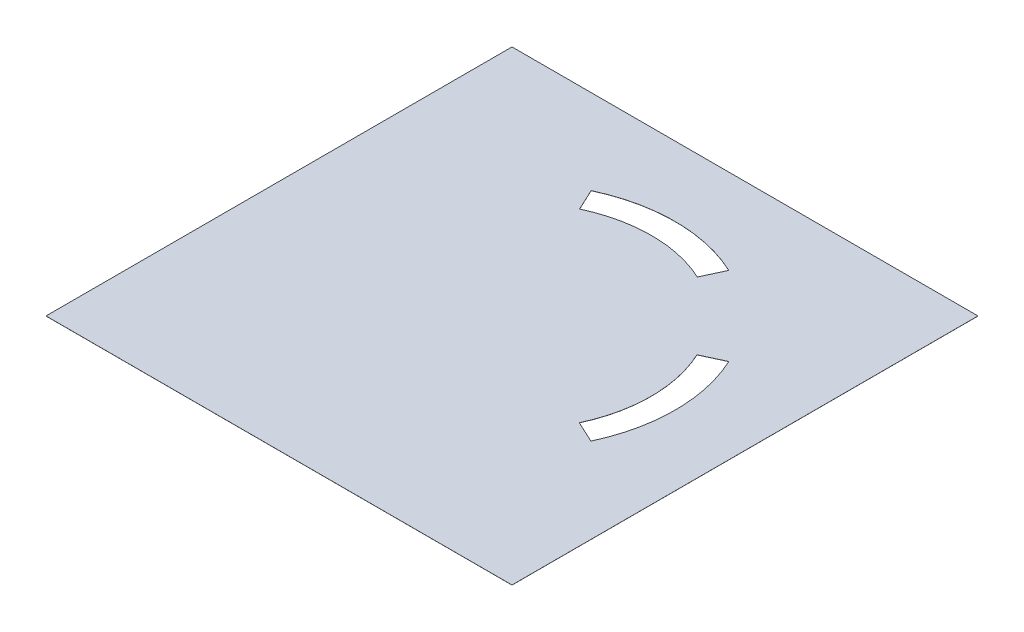
ISO-10303-21;
HEADER;
FILE_DESCRIPTION(('STEP AP214'),'2;1');
FILE_NAME('part.step','',(''),(''),'','','');
FILE_SCHEMA(('AUTOMOTIVE_DESIGN { 1 0 10303 214 1 1 1 1 }'));
ENDSEC;
DATA;
#1=APPLICATION_CONTEXT('core data for automotive mechanical design processes');
#2=APPLICATION_PROTOCOL_DEFINITION('international standard','automotive_design',2000,#1);
#3=PRODUCT_CONTEXT('',#1,'mechanical');
#4=PRODUCT('Part','Part','',(#3));
#5=PRODUCT_RELATED_PRODUCT_CATEGORY('part','',(#4));
#6=PRODUCT_DEFINITION_FORMATION('','',#4);
#7=PRODUCT_DEFINITION_CONTEXT('part definition',#1,'design');
#8=PRODUCT_DEFINITION('design','',#6,#7);
#9=PRODUCT_DEFINITION_SHAPE('','',#8);
#10=(LENGTH_UNIT() NAMED_UNIT(*) SI_UNIT(.MILLI.,.METRE.));
#11=(NAMED_UNIT(*) PLANE_ANGLE_UNIT() SI_UNIT($,.RADIAN.));
#12=(NAMED_UNIT(*) SI_UNIT($,.STERADIAN.) SOLID_ANGLE_UNIT());
#13=UNCERTAINTY_MEASURE_WITH_UNIT(LENGTH_MEASURE(1.E-05),#10,'distance_accuracy_value','');
#14=(GEOMETRIC_REPRESENTATION_CONTEXT(3) GLOBAL_UNCERTAINTY_ASSIGNED_CONTEXT((#13)) GLOBAL_UNIT_ASSIGNED_CONTEXT((#10,
#11,#12)) REPRESENTATION_CONTEXT('',''));
#15=CARTESIAN_POINT('',(0.,0.,0.));
#16=DIRECTION('',(0.,0.,1.));
#17=DIRECTION('',(1.,0.,0.));
#18=AXIS2_PLACEMENT_3D('',#15,#16,#17);
#19=CARTESIAN_POINT('',(0.,0.02,0.));
#20=DIRECTION('',(0.,-1.,0.));
#21=DIRECTION('',(0.,0.,-1.));
#22=AXIS2_PLACEMENT_3D('',#19,#20,#21);
#23=PLANE('',#22);
#24=CARTESIAN_POINT('',(53.5490993647064,0.02,-53.5652361851877));
#25=DIRECTION('',(0.,-1.,0.));
#26=DIRECTION('',(0.,0.,-1.));
#27=AXIS2_PLACEMENT_3D('',#24,#25,#26);
#28=CIRCLE('',#27,32.0102361851877);
#29=CARTESIAN_POINT('',(40.0209889902134,0.02,-82.5763625047057));
#30=VERTEX_POINT('',#29);
#31=CARTESIAN_POINT('',(67.0772097391996,0.02,-82.5763625047056));
#32=VERTEX_POINT('',#31);
#33=EDGE_CURVE('E158',#30,#32,#28,.T.);
#34=ORIENTED_EDGE('',*,*,#33,.F.);
#35=DIRECTION('',(0.422618261740692,0.,0.906307787036653));
#36=VECTOR('',#35,1.);
#37=CARTESIAN_POINT('',(40.0209889902134,0.02,-82.5763625047057));
#38=LINE('',#37,#36);
#39=CARTESIAN_POINT('',(37.6952675499589,0.02,-87.5638882285091));
#40=VERTEX_POINT('',#39);
#41=EDGE_CURVE('E166',#40,#30,#38,.T.);
#42=ORIENTED_EDGE('',*,*,#41,.F.);
#43=CARTESIAN_POINT('',(53.470767951941,0.02,-53.8846169663621));
#44=DIRECTION('',(0.,1.,0.));
#45=DIRECTION('',(0.,0.,-1.));
#46=AXIS2_PLACEMENT_3D('',#43,#44,#45);
#47=CIRCLE('',#46,37.1908554040132);
#48=CARTESIAN_POINT('',(69.3747324500413,0.02,-87.5034158581337));
#49=VERTEX_POINT('',#48);
#50=EDGE_CURVE('E163',#49,#40,#47,.T.);
#51=ORIENTED_EDGE('',*,*,#50,.F.);
#52=DIRECTION('',(0.422618261740697,0.,-0.906307787036651));
#53=VECTOR('',#52,1.);
#54=CARTESIAN_POINT('',(67.0772097391996,0.02,-82.5763625047056));
#55=LINE('',#54,#53);
#56=EDGE_CURVE('E160',#32,#49,#55,.T.);
#57=ORIENTED_EDGE('',*,*,#56,.F.);
#58=EDGE_LOOP('',(#34,#42,#51,#57));
#59=FACE_BOUND('',#58,.T.);
#60=DIRECTION('',(1.,0.,0.));
#61=VECTOR('',#60,1.);
#62=CARTESIAN_POINT('',(0.,0.02,0.));
#63=LINE('',#62,#61);
#64=CARTESIAN_POINT('',(0.,0.02,0.));
#65=VERTEX_POINT('',#64);
#66=CARTESIAN_POINT('',(107.07,0.02,0.));
#67=VERTEX_POINT('',#66);
#68=EDGE_CURVE('E189',#65,#67,#63,.T.);
#69=ORIENTED_EDGE('',*,*,#68,.T.);
#70=DIRECTION('',(0.,0.,-1.));
#71=VECTOR('',#70,1.);
#72=CARTESIAN_POINT('',(107.07,0.02,-107.07));
#73=LINE('',#72,#71);
#74=CARTESIAN_POINT('',(107.07,0.02,-107.07));
#75=VERTEX_POINT('',#74);
#76=EDGE_CURVE('E192',#67,#75,#73,.T.);
#77=ORIENTED_EDGE('',*,*,#76,.T.);
#78=DIRECTION('',(-1.,0.,0.));
#79=VECTOR('',#78,1.);
#80=CARTESIAN_POINT('',(0.,0.02,-107.07));
#81=LINE('',#80,#79);
#82=CARTESIAN_POINT('',(0.,0.02,-107.07));
#83=VERTEX_POINT('',#82);
#84=EDGE_CURVE('E195',#75,#83,#81,.T.);
#85=ORIENTED_EDGE('',*,*,#84,.T.);
#86=DIRECTION('',(0.,0.,1.));
#87=VECTOR('',#86,1.);
#88=CARTESIAN_POINT('',(0.,0.02,0.));
#89=LINE('',#88,#87);
#90=EDGE_CURVE('E197',#83,#65,#89,.T.);
#91=ORIENTED_EDGE('',*,*,#90,.T.);
#92=EDGE_LOOP('',(#69,#77,#85,#91));
#93=FACE_BOUND('',#92,.T.);
#94=CARTESIAN_POINT('',(53.5349999999999,0.02,-53.535));
#95=DIRECTION('',(0.,-1.,0.));
#96=DIRECTION('',(0.,0.,-1.));
#97=AXIS2_PLACEMENT_3D('',#94,#95,#96);
#98=CIRCLE('',#97,31.9800000000001);
#99=CARTESIAN_POINT('',(82.518723029432,0.02,-67.0503320104676));
#100=VERTEX_POINT('',#99);
#101=CARTESIAN_POINT('',(82.5187230294321,0.02,-40.0196679895324));
#102=VERTEX_POINT('',#101);
#103=EDGE_CURVE('E122',#100,#102,#98,.T.);
#104=ORIENTED_EDGE('',*,*,#103,.F.);
#105=DIRECTION('',(-0.906307787036649,0.,0.422618261740701));
#106=VECTOR('',#105,1.);
#107=CARTESIAN_POINT('',(82.518723029432,0.02,-67.0503320104676));
#108=LINE('',#107,#106);
#109=CARTESIAN_POINT('',(87.5034158581336,0.02,-69.3747324500415));
#110=VERTEX_POINT('',#109);
#111=EDGE_CURVE('E144',#110,#100,#108,.T.);
#112=ORIENTED_EDGE('',*,*,#111,.F.);
#113=CARTESIAN_POINT('',(53.535,0.02,-53.535));
#114=DIRECTION('',(0.,1.,0.));
#115=DIRECTION('',(0.,0.,-1.));
#116=AXIS2_PLACEMENT_3D('',#113,#114,#115);
#117=CIRCLE('',#116,37.48);
#118=CARTESIAN_POINT('',(87.5034158581336,0.02,-37.6952675499585));
#119=VERTEX_POINT('',#118);
#120=EDGE_CURVE('E142',#119,#110,#117,.T.);
#121=ORIENTED_EDGE('',*,*,#120,.F.);
#122=DIRECTION('',(0.906307787036649,0.,0.422618261740701));
#123=VECTOR('',#122,1.);
#124=CARTESIAN_POINT('',(82.5187230294321,0.02,-40.0196679895324));
#125=LINE('',#124,#123);
#126=EDGE_CURVE('E130',#102,#119,#125,.T.);
#127=ORIENTED_EDGE('',*,*,#126,.F.);
#128=EDGE_LOOP('',(#104,#112,#121,#127));
#129=FACE_BOUND('',#128,.T.);
#130=ADVANCED_FACE('F33',(#59,#93,#129),#23,.F.);
#131=CARTESIAN_POINT('',(0.,0.,0.));
#132=DIRECTION('',(0.,-1.,0.));
#133=DIRECTION('',(0.,0.,-1.));
#134=AXIS2_PLACEMENT_3D('',#131,#132,#133);
#135=PLANE('',#134);
#136=DIRECTION('',(1.,0.,0.));
#137=VECTOR('',#136,1.);
#138=CARTESIAN_POINT('',(0.,0.,0.));
#139=LINE('',#138,#137);
#140=CARTESIAN_POINT('',(0.,0.,0.));
#141=VERTEX_POINT('',#140);
#142=CARTESIAN_POINT('',(107.07,0.,0.));
#143=VERTEX_POINT('',#142);
#144=EDGE_CURVE('E188',#141,#143,#139,.T.);
#145=ORIENTED_EDGE('',*,*,#144,.F.);
#146=DIRECTION('',(0.,0.,1.));
#147=VECTOR('',#146,1.);
#148=CARTESIAN_POINT('',(0.,0.,0.));
#149=LINE('',#148,#147);
#150=CARTESIAN_POINT('',(0.,0.,-107.07));
#151=VERTEX_POINT('',#150);
#152=EDGE_CURVE('E193',#151,#141,#149,.T.);
#153=ORIENTED_EDGE('',*,*,#152,.F.);
#154=DIRECTION('',(-1.,0.,0.));
#155=VECTOR('',#154,1.);
#156=CARTESIAN_POINT('',(0.,0.,-107.07));
#157=LINE('',#156,#155);
#158=CARTESIAN_POINT('',(107.07,0.,-107.07));
#159=VERTEX_POINT('',#158);
#160=EDGE_CURVE('E204',#159,#151,#157,.T.);
#161=ORIENTED_EDGE('',*,*,#160,.F.);
#162=DIRECTION('',(0.,0.,-1.));
#163=VECTOR('',#162,1.);
#164=CARTESIAN_POINT('',(107.07,0.,-107.07));
#165=LINE('',#164,#163);
#166=EDGE_CURVE('E202',#143,#159,#165,.T.);
#167=ORIENTED_EDGE('',*,*,#166,.F.);
#168=EDGE_LOOP('',(#145,#153,#161,#167));
#169=FACE_BOUND('',#168,.T.);
#170=DIRECTION('',(0.422618261740692,0.,0.906307787036653));
#171=VECTOR('',#170,1.);
#172=CARTESIAN_POINT('',(40.0209889902134,0.,-82.5763625047057));
#173=LINE('',#172,#171);
#174=CARTESIAN_POINT('',(37.6952675499589,0.,-87.5638882285091));
#175=VERTEX_POINT('',#174);
#176=CARTESIAN_POINT('',(40.0209889902134,0.,-82.5763625047057));
#177=VERTEX_POINT('',#176);
#178=EDGE_CURVE('E161',#175,#177,#173,.T.);
#179=ORIENTED_EDGE('',*,*,#178,.T.);
#180=CARTESIAN_POINT('',(53.5490993647064,0.,-53.5652361851877));
#181=DIRECTION('',(0.,-1.,0.));
#182=DIRECTION('',(0.,0.,-1.));
#183=AXIS2_PLACEMENT_3D('',#180,#181,#182);
#184=CIRCLE('',#183,32.0102361851877);
#185=CARTESIAN_POINT('',(67.0772097391996,0.,-82.5763625047056));
#186=VERTEX_POINT('',#185);
#187=EDGE_CURVE('E138',#177,#186,#184,.T.);
#188=ORIENTED_EDGE('',*,*,#187,.T.);
#189=DIRECTION('',(0.422618261740697,0.,-0.906307787036651));
#190=VECTOR('',#189,1.);
#191=CARTESIAN_POINT('',(67.0772097391996,0.,-82.5763625047056));
#192=LINE('',#191,#190);
#193=CARTESIAN_POINT('',(69.3747324500413,0.,-87.5034158581337));
#194=VERTEX_POINT('',#193);
#195=EDGE_CURVE('E171',#186,#194,#192,.T.);
#196=ORIENTED_EDGE('',*,*,#195,.T.);
#197=CARTESIAN_POINT('',(53.470767951941,0.,-53.8846169663621));
#198=DIRECTION('',(0.,1.,0.));
#199=DIRECTION('',(0.,0.,-1.));
#200=AXIS2_PLACEMENT_3D('',#197,#198,#199);
#201=CIRCLE('',#200,37.1908554040132);
#202=EDGE_CURVE('E174',#194,#175,#201,.T.);
#203=ORIENTED_EDGE('',*,*,#202,.T.);
#204=EDGE_LOOP('',(#179,#188,#196,#203));
#205=FACE_BOUND('',#204,.T.);
#206=DIRECTION('',(-0.906307787036649,0.,0.422618261740701));
#207=VECTOR('',#206,1.);
#208=CARTESIAN_POINT('',(82.518723029432,0.,-67.0503320104676));
#209=LINE('',#208,#207);
#210=CARTESIAN_POINT('',(87.5034158581336,0.,-69.3747324500415));
#211=VERTEX_POINT('',#210);
#212=CARTESIAN_POINT('',(82.518723029432,0.,-67.0503320104676));
#213=VERTEX_POINT('',#212);
#214=EDGE_CURVE('E131',#211,#213,#209,.T.);
#215=ORIENTED_EDGE('',*,*,#214,.T.);
#216=CARTESIAN_POINT('',(53.5349999999999,0.,-53.535));
#217=DIRECTION('',(0.,-1.,0.));
#218=DIRECTION('',(0.,0.,-1.));
#219=AXIS2_PLACEMENT_3D('',#216,#217,#218);
#220=CIRCLE('',#219,31.9800000000001);
#221=CARTESIAN_POINT('',(82.5187230294321,0.,-40.0196679895324));
#222=VERTEX_POINT('',#221);
#223=EDGE_CURVE('E56',#213,#222,#220,.T.);
#224=ORIENTED_EDGE('',*,*,#223,.T.);
#225=DIRECTION('',(0.906307787036649,0.,0.422618261740701));
#226=VECTOR('',#225,1.);
#227=CARTESIAN_POINT('',(82.5187230294321,0.,-40.0196679895324));
#228=LINE('',#227,#226);
#229=CARTESIAN_POINT('',(87.5034158581336,0.,-37.6952675499585));
#230=VERTEX_POINT('',#229);
#231=EDGE_CURVE('E137',#222,#230,#228,.T.);
#232=ORIENTED_EDGE('',*,*,#231,.T.);
#233=CARTESIAN_POINT('',(53.535,0.,-53.535));
#234=DIRECTION('',(0.,1.,0.));
#235=DIRECTION('',(0.,0.,-1.));
#236=AXIS2_PLACEMENT_3D('',#233,#234,#235);
#237=CIRCLE('',#236,37.48);
#238=EDGE_CURVE('E150',#230,#211,#237,.T.);
#239=ORIENTED_EDGE('',*,*,#238,.T.);
#240=EDGE_LOOP('',(#215,#224,#232,#239));
#241=FACE_BOUND('',#240,.T.);
#242=ADVANCED_FACE('F222',(#169,#205,#241),#135,.T.);
#243=CARTESIAN_POINT('',(0.,0.02,0.));
#244=DIRECTION('',(0.,0.,-1.));
#245=DIRECTION('',(-1.,0.,0.));
#246=AXIS2_PLACEMENT_3D('',#243,#244,#245);
#247=PLANE('',#246);
#248=ORIENTED_EDGE('',*,*,#144,.T.);
#249=DIRECTION('',(0.,-1.,0.));
#250=VECTOR('',#249,1.);
#251=CARTESIAN_POINT('',(107.07,0.02,0.));
#252=LINE('',#251,#250);
#253=EDGE_CURVE('E11',#67,#143,#252,.T.);
#254=ORIENTED_EDGE('',*,*,#253,.F.);
#255=ORIENTED_EDGE('',*,*,#68,.F.);
#256=DIRECTION('',(0.,-1.,0.));
#257=VECTOR('',#256,1.);
#258=CARTESIAN_POINT('',(0.,0.02,0.));
#259=LINE('',#258,#257);
#260=EDGE_CURVE('E199',#65,#141,#259,.T.);
#261=ORIENTED_EDGE('',*,*,#260,.T.);
#262=EDGE_LOOP('',(#248,#254,#255,#261));
#263=FACE_BOUND('',#262,.T.);
#264=ADVANCED_FACE('F35',(#263),#247,.F.);
#265=CARTESIAN_POINT('',(107.07,0.02,-107.07));
#266=DIRECTION('',(-1.,0.,0.));
#267=DIRECTION('',(0.,0.,1.));
#268=AXIS2_PLACEMENT_3D('',#265,#266,#267);
#269=PLANE('',#268);
#270=ORIENTED_EDGE('',*,*,#166,.T.);
#271=DIRECTION('',(0.,-1.,0.));
#272=VECTOR('',#271,1.);
#273=CARTESIAN_POINT('',(107.07,0.02,-107.07));
#274=LINE('',#273,#272);
#275=EDGE_CURVE('E41',#75,#159,#274,.T.);
#276=ORIENTED_EDGE('',*,*,#275,.F.);
#277=ORIENTED_EDGE('',*,*,#76,.F.);
#278=ORIENTED_EDGE('',*,*,#253,.T.);
#279=EDGE_LOOP('',(#270,#276,#277,#278));
#280=FACE_BOUND('',#279,.T.);
#281=ADVANCED_FACE('F232',(#280),#269,.F.);
#282=CARTESIAN_POINT('',(0.,0.02,-107.07));
#283=DIRECTION('',(0.,0.,1.));
#284=DIRECTION('',(1.,0.,0.));
#285=AXIS2_PLACEMENT_3D('',#282,#283,#284);
#286=PLANE('',#285);
#287=ORIENTED_EDGE('',*,*,#160,.T.);
#288=DIRECTION('',(0.,-1.,0.));
#289=VECTOR('',#288,1.);
#290=CARTESIAN_POINT('',(0.,0.02,-107.07));
#291=LINE('',#290,#289);
#292=EDGE_CURVE('E209',#83,#151,#291,.T.);
#293=ORIENTED_EDGE('',*,*,#292,.F.);
#294=ORIENTED_EDGE('',*,*,#84,.F.);
#295=ORIENTED_EDGE('',*,*,#275,.T.);
#296=EDGE_LOOP('',(#287,#293,#294,#295));
#297=FACE_BOUND('',#296,.T.);
#298=ADVANCED_FACE('F216',(#297),#286,.F.);
#299=CARTESIAN_POINT('',(0.,0.02,0.));
#300=DIRECTION('',(1.,0.,0.));
#301=DIRECTION('',(0.,0.,-1.));
#302=AXIS2_PLACEMENT_3D('',#299,#300,#301);
#303=PLANE('',#302);
#304=ORIENTED_EDGE('',*,*,#152,.T.);
#305=ORIENTED_EDGE('',*,*,#260,.F.);
#306=ORIENTED_EDGE('',*,*,#90,.F.);
#307=ORIENTED_EDGE('',*,*,#292,.T.);
#308=EDGE_LOOP('',(#304,#305,#306,#307));
#309=FACE_BOUND('',#308,.T.);
#310=ADVANCED_FACE('F226',(#309),#303,.F.);
#311=CARTESIAN_POINT('',(53.5490993647064,0.02,-53.5652361851877));
#312=DIRECTION('',(0.,-1.,0.));
#313=DIRECTION('',(0.,0.,-1.));
#314=AXIS2_PLACEMENT_3D('',#311,#312,#313);
#315=CYLINDRICAL_SURFACE('',#314,32.0102361851877);
#316=ORIENTED_EDGE('',*,*,#187,.F.);
#317=DIRECTION('',(0.,-1.,0.));
#318=VECTOR('',#317,1.);
#319=CARTESIAN_POINT('',(40.0209889902134,0.02,-82.5763625047057));
#320=LINE('',#319,#318);
#321=EDGE_CURVE('E168',#30,#177,#320,.T.);
#322=ORIENTED_EDGE('',*,*,#321,.F.);
#323=ORIENTED_EDGE('',*,*,#33,.T.);
#324=DIRECTION('',(0.,-1.,0.));
#325=VECTOR('',#324,1.);
#326=CARTESIAN_POINT('',(67.0772097391996,0.02,-82.5763625047056));
#327=LINE('',#326,#325);
#328=EDGE_CURVE('E185',#32,#186,#327,.T.);
#329=ORIENTED_EDGE('',*,*,#328,.T.);
#330=EDGE_LOOP('',(#316,#322,#323,#329));
#331=FACE_BOUND('',#330,.T.);
#332=ADVANCED_FACE('F248',(#331),#315,.T.);
#333=CARTESIAN_POINT('',(67.0772097391996,0.02,-82.5763625047056));
#334=DIRECTION('',(-0.906307787036651,0.,-0.422618261740697));
#335=DIRECTION('',(-0.422618261740697,0.,0.906307787036651));
#336=AXIS2_PLACEMENT_3D('',#333,#334,#335);
#337=PLANE('',#336);
#338=ORIENTED_EDGE('',*,*,#195,.F.);
#339=ORIENTED_EDGE('',*,*,#328,.F.);
#340=ORIENTED_EDGE('',*,*,#56,.T.);
#341=DIRECTION('',(0.,-1.,0.));
#342=VECTOR('',#341,1.);
#343=CARTESIAN_POINT('',(69.3747324500413,0.02,-87.5034158581337));
#344=LINE('',#343,#342);
#345=EDGE_CURVE('E183',#49,#194,#344,.T.);
#346=ORIENTED_EDGE('',*,*,#345,.T.);
#347=EDGE_LOOP('',(#338,#339,#340,#346));
#348=FACE_BOUND('',#347,.T.);
#349=ADVANCED_FACE('F255',(#348),#337,.T.);
#350=CARTESIAN_POINT('',(53.470767951941,0.02,-53.8846169663621));
#351=DIRECTION('',(0.,-1.,0.));
#352=DIRECTION('',(0.,0.,-1.));
#353=AXIS2_PLACEMENT_3D('',#350,#351,#352);
#354=CYLINDRICAL_SURFACE('',#353,37.1908554040132);
#355=ORIENTED_EDGE('',*,*,#202,.F.);
#356=ORIENTED_EDGE('',*,*,#345,.F.);
#357=ORIENTED_EDGE('',*,*,#50,.T.);
#358=DIRECTION('',(0.,-1.,0.));
#359=VECTOR('',#358,1.);
#360=CARTESIAN_POINT('',(37.6952675499589,0.02,-87.5638882285091));
#361=LINE('',#360,#359);
#362=EDGE_CURVE('E181',#40,#175,#361,.T.);
#363=ORIENTED_EDGE('',*,*,#362,.T.);
#364=EDGE_LOOP('',(#355,#356,#357,#363));
#365=FACE_BOUND('',#364,.T.);
#366=ADVANCED_FACE('F260',(#365),#354,.F.);
#367=CARTESIAN_POINT('',(40.0209889902134,0.02,-82.5763625047057));
#368=DIRECTION('',(0.906307787036653,0.,-0.422618261740692));
#369=DIRECTION('',(-0.422618261740692,0.,-0.906307787036653));
#370=AXIS2_PLACEMENT_3D('',#367,#368,#369);
#371=PLANE('',#370);
#372=ORIENTED_EDGE('',*,*,#178,.F.);
#373=ORIENTED_EDGE('',*,*,#362,.F.);
#374=ORIENTED_EDGE('',*,*,#41,.T.);
#375=ORIENTED_EDGE('',*,*,#321,.T.);
#376=EDGE_LOOP('',(#372,#373,#374,#375));
#377=FACE_BOUND('',#376,.T.);
#378=ADVANCED_FACE('F266',(#377),#371,.T.);
#379=CARTESIAN_POINT('',(53.5349999999999,0.02,-53.535));
#380=DIRECTION('',(0.,-1.,0.));
#381=DIRECTION('',(0.,0.,-1.));
#382=AXIS2_PLACEMENT_3D('',#379,#380,#381);
#383=CYLINDRICAL_SURFACE('',#382,31.9800000000001);
#384=ORIENTED_EDGE('',*,*,#223,.F.);
#385=DIRECTION('',(0.,-1.,0.));
#386=VECTOR('',#385,1.);
#387=CARTESIAN_POINT('',(82.518723029432,0.02,-67.0503320104676));
#388=LINE('',#387,#386);
#389=EDGE_CURVE('E126',#100,#213,#388,.T.);
#390=ORIENTED_EDGE('',*,*,#389,.F.);
#391=ORIENTED_EDGE('',*,*,#103,.T.);
#392=DIRECTION('',(0.,-1.,0.));
#393=VECTOR('',#392,1.);
#394=CARTESIAN_POINT('',(82.5187230294321,0.02,-40.0196679895324));
#395=LINE('',#394,#393);
#396=EDGE_CURVE('E125',#102,#222,#395,.T.);
#397=ORIENTED_EDGE('',*,*,#396,.T.);
#398=EDGE_LOOP('',(#384,#390,#391,#397));
#399=FACE_BOUND('',#398,.T.);
#400=ADVANCED_FACE('F124',(#399),#383,.T.);
#401=CARTESIAN_POINT('',(82.5187230294321,0.02,-40.0196679895324));
#402=DIRECTION('',(0.422618261740701,0.,-0.906307787036649));
#403=DIRECTION('',(-0.906307787036649,0.,-0.422618261740701));
#404=AXIS2_PLACEMENT_3D('',#401,#402,#403);
#405=PLANE('',#404);
#406=ORIENTED_EDGE('',*,*,#231,.F.);
#407=ORIENTED_EDGE('',*,*,#396,.F.);
#408=ORIENTED_EDGE('',*,*,#126,.T.);
#409=DIRECTION('',(0.,-1.,0.));
#410=VECTOR('',#409,1.);
#411=CARTESIAN_POINT('',(87.5034158581336,0.02,-37.6952675499585));
#412=LINE('',#411,#410);
#413=EDGE_CURVE('E139',#119,#230,#412,.T.);
#414=ORIENTED_EDGE('',*,*,#413,.T.);
#415=EDGE_LOOP('',(#406,#407,#408,#414));
#416=FACE_BOUND('',#415,.T.);
#417=ADVANCED_FACE('F134',(#416),#405,.T.);
#418=CARTESIAN_POINT('',(53.535,0.02,-53.535));
#419=DIRECTION('',(0.,-1.,0.));
#420=DIRECTION('',(0.,0.,-1.));
#421=AXIS2_PLACEMENT_3D('',#418,#419,#420);
#422=CYLINDRICAL_SURFACE('',#421,37.48);
#423=ORIENTED_EDGE('',*,*,#238,.F.);
#424=ORIENTED_EDGE('',*,*,#413,.F.);
#425=ORIENTED_EDGE('',*,*,#120,.T.);
#426=DIRECTION('',(0.,-1.,0.));
#427=VECTOR('',#426,1.);
#428=CARTESIAN_POINT('',(87.5034158581336,0.02,-69.3747324500415));
#429=LINE('',#428,#427);
#430=EDGE_CURVE('E48',#110,#211,#429,.T.);
#431=ORIENTED_EDGE('',*,*,#430,.T.);
#432=EDGE_LOOP('',(#423,#424,#425,#431));
#433=FACE_BOUND('',#432,.T.);
#434=ADVANCED_FACE('F285',(#433),#422,.F.);
#435=CARTESIAN_POINT('',(82.518723029432,0.02,-67.0503320104676));
#436=DIRECTION('',(0.422618261740701,0.,0.906307787036649));
#437=DIRECTION('',(0.906307787036649,0.,-0.422618261740701));
#438=AXIS2_PLACEMENT_3D('',#435,#436,#437);
#439=PLANE('',#438);
#440=ORIENTED_EDGE('',*,*,#214,.F.);
#441=ORIENTED_EDGE('',*,*,#430,.F.);
#442=ORIENTED_EDGE('',*,*,#111,.T.);
#443=ORIENTED_EDGE('',*,*,#389,.T.);
#444=EDGE_LOOP('',(#440,#441,#442,#443));
#445=FACE_BOUND('',#444,.T.);
#446=ADVANCED_FACE('F288',(#445),#439,.T.);
#447=CLOSED_SHELL('',(#130,#242,#264,#281,#298,#310,#332,#349,#366,#378,#400,#417,#434,#446));
#448=MANIFOLD_SOLID_BREP('B2',#447);
#449=ADVANCED_BREP_SHAPE_REPRESENTATION('',(#18,#448),#14);
#450=SHAPE_DEFINITION_REPRESENTATION(#9,#449);
ENDSEC;
END-ISO-10303-21;
